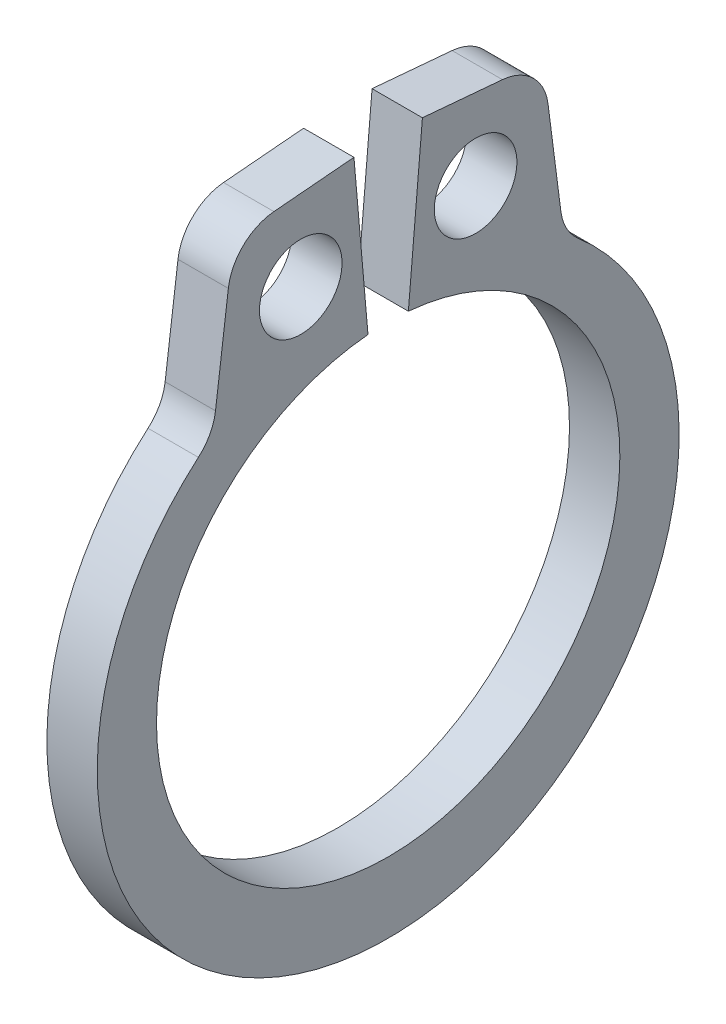
ISO-10303-21;
HEADER;
FILE_DESCRIPTION(('STEP AP214'),'2;1');
FILE_NAME('part.step','',(''),(''),'','','');
FILE_SCHEMA(('AUTOMOTIVE_DESIGN { 1 0 10303 214 1 1 1 1 }'));
ENDSEC;
DATA;
#1=APPLICATION_CONTEXT('core data for automotive mechanical design processes');
#2=APPLICATION_PROTOCOL_DEFINITION('international standard','automotive_design',2000,#1);
#3=PRODUCT_CONTEXT('',#1,'mechanical');
#4=PRODUCT('Part','Part','',(#3));
#5=PRODUCT_RELATED_PRODUCT_CATEGORY('part','',(#4));
#6=PRODUCT_DEFINITION_FORMATION('','',#4);
#7=PRODUCT_DEFINITION_CONTEXT('part definition',#1,'design');
#8=PRODUCT_DEFINITION('design','',#6,#7);
#9=PRODUCT_DEFINITION_SHAPE('','',#8);
#10=(LENGTH_UNIT() NAMED_UNIT(*) SI_UNIT(.MILLI.,.METRE.));
#11=(NAMED_UNIT(*) PLANE_ANGLE_UNIT() SI_UNIT($,.RADIAN.));
#12=(NAMED_UNIT(*) SI_UNIT($,.STERADIAN.) SOLID_ANGLE_UNIT());
#13=UNCERTAINTY_MEASURE_WITH_UNIT(LENGTH_MEASURE(1.E-05),#10,'distance_accuracy_value','');
#14=(GEOMETRIC_REPRESENTATION_CONTEXT(3) GLOBAL_UNCERTAINTY_ASSIGNED_CONTEXT((#13)) GLOBAL_UNIT_ASSIGNED_CONTEXT((#10,
#11,#12)) REPRESENTATION_CONTEXT('',''));
#15=CARTESIAN_POINT('',(0.,0.,0.));
#16=DIRECTION('',(0.,0.,1.));
#17=DIRECTION('',(1.,0.,0.));
#18=AXIS2_PLACEMENT_3D('',#15,#16,#17);
#19=CARTESIAN_POINT('',(0.3175,0.,0.));
#20=DIRECTION('',(1.,0.,0.));
#21=DIRECTION('',(0.,0.,-1.));
#22=AXIS2_PLACEMENT_3D('',#19,#20,#21);
#23=PLANE('',#22);
#24=CARTESIAN_POINT('',(0.3175,3.85560585041349,-1.10223251914344));
#25=DIRECTION('',(-1.,0.,0.));
#26=DIRECTION('',(0.,0.,1.));
#27=AXIS2_PLACEMENT_3D('',#24,#25,#26);
#28=CIRCLE('',#27,0.5207);
#29=CARTESIAN_POINT('',(0.3175,3.85560585041349,-0.581532519143441));
#30=VERTEX_POINT('',#29);
#31=EDGE_CURVE('E108',#30,#30,#28,.T.);
#32=ORIENTED_EDGE('',*,*,#31,.T.);
#33=EDGE_LOOP('',(#32));
#34=FACE_BOUND('',#33,.T.);
#35=CARTESIAN_POINT('',(0.3175,0.,0.));
#36=DIRECTION('',(-1.,0.,0.));
#37=DIRECTION('',(0.,0.,1.));
#38=AXIS2_PLACEMENT_3D('',#35,#36,#37);
#39=CIRCLE('',#38,2.921);
#40=CARTESIAN_POINT('',(0.3175,2.90988471312599,-0.25458192456591));
#41=VERTEX_POINT('',#40);
#42=CARTESIAN_POINT('',(0.3175,2.90988471312599,0.25458192456591));
#43=VERTEX_POINT('',#42);
#44=EDGE_CURVE('E174',#41,#43,#39,.T.);
#45=ORIENTED_EDGE('',*,*,#44,.T.);
#46=DIRECTION('',(0.,-0.996194698091746,-0.0871557427476584));
#47=VECTOR('',#46,1.);
#48=CARTESIAN_POINT('',(0.3175,2.90988471312599,0.25458192456591));
#49=LINE('',#48,#47);
#50=CARTESIAN_POINT('',(0.3175,4.93415233964842,0.431682393829152));
#51=VERTEX_POINT('',#50);
#52=EDGE_CURVE('E124',#43,#51,#49,.F.);
#53=ORIENTED_EDGE('',*,*,#52,.T.);
#54=DIRECTION('',(0.,0.0871557427476587,-0.996194698091746));
#55=VECTOR('',#54,1.);
#56=CARTESIAN_POINT('',(0.3175,4.93415233964842,0.431682393829152));
#57=LINE('',#56,#55);
#58=CARTESIAN_POINT('',(0.3175,4.84586515186069,1.44080956790658));
#59=VERTEX_POINT('',#58);
#60=EDGE_CURVE('E119',#51,#59,#57,.F.);
#61=ORIENTED_EDGE('',*,*,#60,.T.);
#62=CARTESIAN_POINT('',(0.3175,4.21328151857243,1.38546567126182));
#63=DIRECTION('',(-1.,0.,0.));
#64=DIRECTION('',(0.,0.,1.));
#65=AXIS2_PLACEMENT_3D('',#62,#63,#64);
#66=CIRCLE('',#65,0.635);
#67=CARTESIAN_POINT('',(0.3175,4.2945067237745,2.01524933732492));
#68=VERTEX_POINT('',#67);
#69=EDGE_CURVE('E112',#68,#59,#66,.T.);
#70=ORIENTED_EDGE('',*,*,#69,.F.);
#71=DIRECTION('',(0.,0.991785300886776,-0.127913708979639));
#72=VECTOR('',#71,1.);
#73=CARTESIAN_POINT('',(0.3175,4.80132698770098,1.94988311372097));
#74=LINE('',#73,#72);
#75=CARTESIAN_POINT('',(0.3175,3.03853740820642,2.17723570007429));
#76=VERTEX_POINT('',#75);
#77=EDGE_CURVE('E107',#68,#76,#74,.F.);
#78=ORIENTED_EDGE('',*,*,#77,.T.);
#79=CARTESIAN_POINT('',(0.3175,3.11976261340849,2.80701936613739));
#80=DIRECTION('',(-1.,0.,0.));
#81=DIRECTION('',(0.,0.,1.));
#82=AXIS2_PLACEMENT_3D('',#79,#80,#81);
#83=CIRCLE('',#82,0.635);
#84=CARTESIAN_POINT('',(0.3175,2.63846487393826,2.39280023816181));
#85=VERTEX_POINT('',#84);
#86=EDGE_CURVE('E98',#76,#85,#83,.T.);
#87=ORIENTED_EDGE('',*,*,#86,.T.);
#88=CARTESIAN_POINT('',(0.3175,-0.141825237867011,0.));
#89=DIRECTION('',(-1.,0.,0.));
#90=DIRECTION('',(0.,0.,1.));
#91=AXIS2_PLACEMENT_3D('',#88,#89,#90);
#92=CIRCLE('',#91,3.66817476213299);
#93=CARTESIAN_POINT('',(0.3175,2.63846487393826,-2.39280023816181));
#94=VERTEX_POINT('',#93);
#95=EDGE_CURVE('E181',#94,#85,#92,.T.);
#96=ORIENTED_EDGE('',*,*,#95,.F.);
#97=CARTESIAN_POINT('',(0.3175,3.11976261340849,-2.80701936613739));
#98=DIRECTION('',(-1.,0.,0.));
#99=DIRECTION('',(0.,0.,1.));
#100=AXIS2_PLACEMENT_3D('',#97,#98,#99);
#101=CIRCLE('',#100,0.635);
#102=CARTESIAN_POINT('',(0.3175,3.03853740820642,-2.17723570007429));
#103=VERTEX_POINT('',#102);
#104=EDGE_CURVE('E178',#94,#103,#101,.T.);
#105=ORIENTED_EDGE('',*,*,#104,.T.);
#106=DIRECTION('',(0.,-0.991785300886776,-0.127913708979639));
#107=VECTOR('',#106,1.);
#108=CARTESIAN_POINT('',(0.3175,4.80132698770098,-1.94988311372097));
#109=LINE('',#108,#107);
#110=CARTESIAN_POINT('',(0.3175,4.2945067237745,-2.01524933732492));
#111=VERTEX_POINT('',#110);
#112=EDGE_CURVE('E143',#103,#111,#109,.F.);
#113=ORIENTED_EDGE('',*,*,#112,.T.);
#114=CARTESIAN_POINT('',(0.3175,4.21328151857243,-1.38546567126182));
#115=DIRECTION('',(-1.,0.,0.));
#116=DIRECTION('',(0.,0.,1.));
#117=AXIS2_PLACEMENT_3D('',#114,#115,#116);
#118=CIRCLE('',#117,0.635);
#119=CARTESIAN_POINT('',(0.3175,4.84586515186069,-1.44080956790658));
#120=VERTEX_POINT('',#119);
#121=EDGE_CURVE('E145',#120,#111,#118,.T.);
#122=ORIENTED_EDGE('',*,*,#121,.F.);
#123=DIRECTION('',(0.,-0.0871557427476587,-0.996194698091746));
#124=VECTOR('',#123,1.);
#125=CARTESIAN_POINT('',(0.3175,4.93415233964842,-0.431682393829152));
#126=LINE('',#125,#124);
#127=CARTESIAN_POINT('',(0.3175,4.93415233964842,-0.431682393829152));
#128=VERTEX_POINT('',#127);
#129=EDGE_CURVE('E137',#120,#128,#126,.F.);
#130=ORIENTED_EDGE('',*,*,#129,.T.);
#131=DIRECTION('',(0.,0.996194698091746,-0.0871557427476584));
#132=VECTOR('',#131,1.);
#133=CARTESIAN_POINT('',(0.3175,2.90988471312599,-0.25458192456591));
#134=LINE('',#133,#132);
#135=EDGE_CURVE('E130',#128,#41,#134,.F.);
#136=ORIENTED_EDGE('',*,*,#135,.T.);
#137=EDGE_LOOP('',(#45,#53,#61,#70,#78,#87,#96,#105,#113,#122,#130,#136));
#138=FACE_BOUND('',#137,.T.);
#139=CARTESIAN_POINT('',(0.3175,3.85560585041349,1.10223251914344));
#140=DIRECTION('',(-1.,0.,0.));
#141=DIRECTION('',(0.,0.,1.));
#142=AXIS2_PLACEMENT_3D('',#139,#140,#141);
#143=CIRCLE('',#142,0.5207);
#144=CARTESIAN_POINT('',(0.3175,3.85560585041349,1.62293251914344));
#145=VERTEX_POINT('',#144);
#146=EDGE_CURVE('E20',#145,#145,#143,.T.);
#147=ORIENTED_EDGE('',*,*,#146,.T.);
#148=EDGE_LOOP('',(#147));
#149=FACE_BOUND('',#148,.T.);
#150=ADVANCED_FACE('F17',(#34,#138,#149),#23,.T.);
#151=CARTESIAN_POINT('',(0.3175,3.85560585041349,1.10223251914344));
#152=DIRECTION('',(-1.,0.,0.));
#153=DIRECTION('',(0.,0.,1.));
#154=AXIS2_PLACEMENT_3D('',#151,#152,#153);
#155=CYLINDRICAL_SURFACE('',#154,0.5207);
#156=CARTESIAN_POINT('',(-0.3175,3.85560585041349,1.10223251914344));
#157=DIRECTION('',(-1.,0.,0.));
#158=DIRECTION('',(0.,0.,1.));
#159=AXIS2_PLACEMENT_3D('',#156,#157,#158);
#160=CIRCLE('',#159,0.5207);
#161=CARTESIAN_POINT('',(-0.3175,3.85560585041349,1.62293251914344));
#162=VERTEX_POINT('',#161);
#163=EDGE_CURVE('E168',#162,#162,#160,.T.);
#164=ORIENTED_EDGE('',*,*,#163,.T.);
#165=EDGE_LOOP('',(#164));
#166=FACE_BOUND('',#165,.T.);
#167=ORIENTED_EDGE('',*,*,#146,.F.);
#168=EDGE_LOOP('',(#167));
#169=FACE_BOUND('',#168,.T.);
#170=ADVANCED_FACE('F388',(#166,#169),#155,.F.);
#171=CARTESIAN_POINT('',(0.3175,3.11976261340849,2.80701936613739));
#172=DIRECTION('',(-1.,0.,0.));
#173=DIRECTION('',(0.,0.,1.));
#174=AXIS2_PLACEMENT_3D('',#171,#172,#173);
#175=CYLINDRICAL_SURFACE('',#174,0.635);
#176=DIRECTION('',(1.,0.,0.));
#177=VECTOR('',#176,1.);
#178=CARTESIAN_POINT('',(0.3175,3.03853740820642,2.17723570007429));
#179=LINE('',#178,#177);
#180=CARTESIAN_POINT('',(-0.3175,3.03853740820642,2.17723570007429));
#181=VERTEX_POINT('',#180);
#182=EDGE_CURVE('E102',#76,#181,#179,.F.);
#183=ORIENTED_EDGE('',*,*,#182,.T.);
#184=CARTESIAN_POINT('',(-0.3175,3.11976261340849,2.80701936613739));
#185=DIRECTION('',(-1.,0.,0.));
#186=DIRECTION('',(0.,0.,1.));
#187=AXIS2_PLACEMENT_3D('',#184,#185,#186);
#188=CIRCLE('',#187,0.635);
#189=CARTESIAN_POINT('',(-0.3175,2.63846487393826,2.39280023816181));
#190=VERTEX_POINT('',#189);
#191=EDGE_CURVE('E166',#181,#190,#188,.T.);
#192=ORIENTED_EDGE('',*,*,#191,.T.);
#193=DIRECTION('',(-1.,0.,0.));
#194=VECTOR('',#193,1.);
#195=CARTESIAN_POINT('',(0.3175,2.63846487393826,2.39280023816181));
#196=LINE('',#195,#194);
#197=EDGE_CURVE('E103',#85,#190,#196,.T.);
#198=ORIENTED_EDGE('',*,*,#197,.F.);
#199=ORIENTED_EDGE('',*,*,#86,.F.);
#200=EDGE_LOOP('',(#183,#192,#198,#199));
#201=FACE_BOUND('',#200,.T.);
#202=ADVANCED_FACE('F100',(#201),#175,.F.);
#203=CARTESIAN_POINT('',(0.3175,-0.141825237867011,0.));
#204=DIRECTION('',(-1.,0.,0.));
#205=DIRECTION('',(0.,0.,1.));
#206=AXIS2_PLACEMENT_3D('',#203,#204,#205);
#207=CYLINDRICAL_SURFACE('',#206,3.66817476213299);
#208=CARTESIAN_POINT('',(-0.3175,-0.141825237867011,0.));
#209=DIRECTION('',(-1.,0.,0.));
#210=DIRECTION('',(0.,0.,1.));
#211=AXIS2_PLACEMENT_3D('',#208,#209,#210);
#212=CIRCLE('',#211,3.66817476213299);
#213=CARTESIAN_POINT('',(-0.3175,2.63846487393826,-2.39280023816181));
#214=VERTEX_POINT('',#213);
#215=EDGE_CURVE('E164',#190,#214,#212,.F.);
#216=ORIENTED_EDGE('',*,*,#215,.T.);
#217=DIRECTION('',(-1.,0.,0.));
#218=VECTOR('',#217,1.);
#219=CARTESIAN_POINT('',(0.3175,2.63846487393826,-2.39280023816181));
#220=LINE('',#219,#218);
#221=EDGE_CURVE('E180',#214,#94,#220,.F.);
#222=ORIENTED_EDGE('',*,*,#221,.T.);
#223=ORIENTED_EDGE('',*,*,#95,.T.);
#224=ORIENTED_EDGE('',*,*,#197,.T.);
#225=EDGE_LOOP('',(#216,#222,#223,#224));
#226=FACE_BOUND('',#225,.T.);
#227=ADVANCED_FACE('F186',(#226),#207,.T.);
#228=CARTESIAN_POINT('',(0.3175,3.11976261340849,-2.80701936613739));
#229=DIRECTION('',(-1.,0.,0.));
#230=DIRECTION('',(0.,0.,1.));
#231=AXIS2_PLACEMENT_3D('',#228,#229,#230);
#232=CYLINDRICAL_SURFACE('',#231,0.635);
#233=ORIENTED_EDGE('',*,*,#221,.F.);
#234=CARTESIAN_POINT('',(-0.3175,3.11976261340849,-2.80701936613739));
#235=DIRECTION('',(-1.,0.,0.));
#236=DIRECTION('',(0.,0.,1.));
#237=AXIS2_PLACEMENT_3D('',#234,#235,#236);
#238=CIRCLE('',#237,0.635);
#239=CARTESIAN_POINT('',(-0.3175,3.03853740820642,-2.17723570007429));
#240=VERTEX_POINT('',#239);
#241=EDGE_CURVE('E161',#214,#240,#238,.T.);
#242=ORIENTED_EDGE('',*,*,#241,.T.);
#243=DIRECTION('',(1.,0.,0.));
#244=VECTOR('',#243,1.);
#245=CARTESIAN_POINT('',(0.3175,3.03853740820642,-2.17723570007429));
#246=LINE('',#245,#244);
#247=EDGE_CURVE('E146',#240,#103,#246,.T.);
#248=ORIENTED_EDGE('',*,*,#247,.T.);
#249=ORIENTED_EDGE('',*,*,#104,.F.);
#250=EDGE_LOOP('',(#233,#242,#248,#249));
#251=FACE_BOUND('',#250,.T.);
#252=ADVANCED_FACE('F198',(#251),#232,.F.);
#253=CARTESIAN_POINT('',(0.3175,4.80132698770098,-1.94988311372097));
#254=DIRECTION('',(0.,-0.127913708979639,0.991785300886776));
#255=DIRECTION('',(0.,-0.991785300886776,-0.127913708979639));
#256=AXIS2_PLACEMENT_3D('',#253,#254,#255);
#257=PLANE('',#256);
#258=ORIENTED_EDGE('',*,*,#247,.F.);
#259=DIRECTION('',(0.,0.991785300886776,0.127913708979639));
#260=VECTOR('',#259,1.);
#261=CARTESIAN_POINT('',(-0.3175,3.03853740820642,-2.17723570007429));
#262=LINE('',#261,#260);
#263=CARTESIAN_POINT('',(-0.3175,4.2945067237745,-2.01524933732492));
#264=VERTEX_POINT('',#263);
#265=EDGE_CURVE('E160',#240,#264,#262,.T.);
#266=ORIENTED_EDGE('',*,*,#265,.T.);
#267=DIRECTION('',(-1.,0.,0.));
#268=VECTOR('',#267,1.);
#269=CARTESIAN_POINT('',(0.3175,4.2945067237745,-2.01524933732492));
#270=LINE('',#269,#268);
#271=EDGE_CURVE('E177',#111,#264,#270,.T.);
#272=ORIENTED_EDGE('',*,*,#271,.F.);
#273=ORIENTED_EDGE('',*,*,#112,.F.);
#274=EDGE_LOOP('',(#258,#266,#272,#273));
#275=FACE_BOUND('',#274,.T.);
#276=ADVANCED_FACE('F203',(#275),#257,.F.);
#277=CARTESIAN_POINT('',(0.3175,4.21328151857243,-1.38546567126182));
#278=DIRECTION('',(-1.,0.,0.));
#279=DIRECTION('',(0.,0.,1.));
#280=AXIS2_PLACEMENT_3D('',#277,#278,#279);
#281=CYLINDRICAL_SURFACE('',#280,0.635);
#282=CARTESIAN_POINT('',(-0.3175,4.21328151857243,-1.38546567126182));
#283=DIRECTION('',(-1.,0.,0.));
#284=DIRECTION('',(0.,0.,1.));
#285=AXIS2_PLACEMENT_3D('',#282,#283,#284);
#286=CIRCLE('',#285,0.635);
#287=CARTESIAN_POINT('',(-0.3175,4.84586515186069,-1.44080956790658));
#288=VERTEX_POINT('',#287);
#289=EDGE_CURVE('E156',#264,#288,#286,.F.);
#290=ORIENTED_EDGE('',*,*,#289,.T.);
#291=DIRECTION('',(1.,0.,0.));
#292=VECTOR('',#291,1.);
#293=CARTESIAN_POINT('',(0.3175,4.84586515186069,-1.44080956790658));
#294=LINE('',#293,#292);
#295=EDGE_CURVE('E140',#288,#120,#294,.T.);
#296=ORIENTED_EDGE('',*,*,#295,.T.);
#297=ORIENTED_EDGE('',*,*,#121,.T.);
#298=ORIENTED_EDGE('',*,*,#271,.T.);
#299=EDGE_LOOP('',(#290,#296,#297,#298));
#300=FACE_BOUND('',#299,.T.);
#301=ADVANCED_FACE('F266',(#300),#281,.T.);
#302=CARTESIAN_POINT('',(0.3175,4.93415233964842,-0.431682393829152));
#303=DIRECTION('',(0.,-0.996194698091746,0.0871557427476587));
#304=DIRECTION('',(0.,-0.0871557427476587,-0.996194698091746));
#305=AXIS2_PLACEMENT_3D('',#302,#303,#304);
#306=PLANE('',#305);
#307=ORIENTED_EDGE('',*,*,#295,.F.);
#308=DIRECTION('',(0.,0.0871557427476588,0.996194698091746));
#309=VECTOR('',#308,1.);
#310=CARTESIAN_POINT('',(-0.3175,4.84586515186069,-1.44080956790658));
#311=LINE('',#310,#309);
#312=CARTESIAN_POINT('',(-0.3175,4.93415233964842,-0.431682393829152));
#313=VERTEX_POINT('',#312);
#314=EDGE_CURVE('E159',#288,#313,#311,.T.);
#315=ORIENTED_EDGE('',*,*,#314,.T.);
#316=DIRECTION('',(1.,0.,0.));
#317=VECTOR('',#316,1.);
#318=CARTESIAN_POINT('',(0.3175,4.93415233964842,-0.431682393829152));
#319=LINE('',#318,#317);
#320=EDGE_CURVE('E134',#313,#128,#319,.T.);
#321=ORIENTED_EDGE('',*,*,#320,.T.);
#322=ORIENTED_EDGE('',*,*,#129,.F.);
#323=EDGE_LOOP('',(#307,#315,#321,#322));
#324=FACE_BOUND('',#323,.T.);
#325=ADVANCED_FACE('F264',(#324),#306,.F.);
#326=CARTESIAN_POINT('',(0.3175,2.90988471312599,-0.25458192456591));
#327=DIRECTION('',(0.,-0.0871557427476584,-0.996194698091746));
#328=DIRECTION('',(0.,0.996194698091746,-0.0871557427476584));
#329=AXIS2_PLACEMENT_3D('',#326,#327,#328);
#330=PLANE('',#329);
#331=DIRECTION('',(-1.,0.,0.));
#332=VECTOR('',#331,1.);
#333=CARTESIAN_POINT('',(0.3175,2.90988471312599,-0.25458192456591));
#334=LINE('',#333,#332);
#335=CARTESIAN_POINT('',(-0.3175,2.90988471312599,-0.25458192456591));
#336=VERTEX_POINT('',#335);
#337=EDGE_CURVE('E133',#336,#41,#334,.F.);
#338=ORIENTED_EDGE('',*,*,#337,.T.);
#339=ORIENTED_EDGE('',*,*,#135,.F.);
#340=ORIENTED_EDGE('',*,*,#320,.F.);
#341=DIRECTION('',(0.,-0.996194698091746,0.0871557427476584));
#342=VECTOR('',#341,1.);
#343=CARTESIAN_POINT('',(-0.3175,4.93415233964842,-0.431682393829152));
#344=LINE('',#343,#342);
#345=EDGE_CURVE('E155',#313,#336,#344,.T.);
#346=ORIENTED_EDGE('',*,*,#345,.T.);
#347=EDGE_LOOP('',(#338,#339,#340,#346));
#348=FACE_BOUND('',#347,.T.);
#349=ADVANCED_FACE('F259',(#348),#330,.F.);
#350=CARTESIAN_POINT('',(0.3175,0.,0.));
#351=DIRECTION('',(-1.,0.,0.));
#352=DIRECTION('',(0.,0.,1.));
#353=AXIS2_PLACEMENT_3D('',#350,#351,#352);
#354=CYLINDRICAL_SURFACE('',#353,2.921);
#355=ORIENTED_EDGE('',*,*,#44,.F.);
#356=ORIENTED_EDGE('',*,*,#337,.F.);
#357=CARTESIAN_POINT('',(-0.3175,0.,0.));
#358=DIRECTION('',(-1.,0.,0.));
#359=DIRECTION('',(0.,0.,1.));
#360=AXIS2_PLACEMENT_3D('',#357,#358,#359);
#361=CIRCLE('',#360,2.921);
#362=CARTESIAN_POINT('',(-0.3175,2.90988471312599,0.25458192456591));
#363=VERTEX_POINT('',#362);
#364=EDGE_CURVE('E152',#336,#363,#361,.T.);
#365=ORIENTED_EDGE('',*,*,#364,.T.);
#366=DIRECTION('',(1.,0.,0.));
#367=VECTOR('',#366,1.);
#368=CARTESIAN_POINT('',(0.3175,2.90988471312599,0.25458192456591));
#369=LINE('',#368,#367);
#370=EDGE_CURVE('E127',#363,#43,#369,.T.);
#371=ORIENTED_EDGE('',*,*,#370,.T.);
#372=EDGE_LOOP('',(#355,#356,#365,#371));
#373=FACE_BOUND('',#372,.T.);
#374=ADVANCED_FACE('F254',(#373),#354,.F.);
#375=CARTESIAN_POINT('',(0.3175,2.90988471312599,0.25458192456591));
#376=DIRECTION('',(0.,-0.0871557427476584,0.996194698091746));
#377=DIRECTION('',(0.,-0.996194698091746,-0.0871557427476584));
#378=AXIS2_PLACEMENT_3D('',#375,#376,#377);
#379=PLANE('',#378);
#380=DIRECTION('',(1.,0.,0.));
#381=VECTOR('',#380,1.);
#382=CARTESIAN_POINT('',(0.3175,4.93415233964842,0.431682393829152));
#383=LINE('',#382,#381);
#384=CARTESIAN_POINT('',(-0.3175,4.93415233964842,0.431682393829152));
#385=VERTEX_POINT('',#384);
#386=EDGE_CURVE('E121',#385,#51,#383,.T.);
#387=ORIENTED_EDGE('',*,*,#386,.T.);
#388=ORIENTED_EDGE('',*,*,#52,.F.);
#389=ORIENTED_EDGE('',*,*,#370,.F.);
#390=DIRECTION('',(0.,0.996194698091746,0.0871557427476584));
#391=VECTOR('',#390,1.);
#392=CARTESIAN_POINT('',(-0.3175,2.90988471312599,0.25458192456591));
#393=LINE('',#392,#391);
#394=EDGE_CURVE('E154',#363,#385,#393,.T.);
#395=ORIENTED_EDGE('',*,*,#394,.T.);
#396=EDGE_LOOP('',(#387,#388,#389,#395));
#397=FACE_BOUND('',#396,.T.);
#398=ADVANCED_FACE('F251',(#397),#379,.F.);
#399=CARTESIAN_POINT('',(0.3175,4.93415233964842,0.431682393829152));
#400=DIRECTION('',(0.,-0.996194698091746,-0.0871557427476587));
#401=DIRECTION('',(0.,0.0871557427476587,-0.996194698091746));
#402=AXIS2_PLACEMENT_3D('',#399,#400,#401);
#403=PLANE('',#402);
#404=DIRECTION('',(-1.,0.,0.));
#405=VECTOR('',#404,1.);
#406=CARTESIAN_POINT('',(0.3175,4.84586515186069,1.44080956790658));
#407=LINE('',#406,#405);
#408=CARTESIAN_POINT('',(-0.3175,4.84586515186069,1.44080956790658));
#409=VERTEX_POINT('',#408);
#410=EDGE_CURVE('E114',#59,#409,#407,.T.);
#411=ORIENTED_EDGE('',*,*,#410,.F.);
#412=ORIENTED_EDGE('',*,*,#60,.F.);
#413=ORIENTED_EDGE('',*,*,#386,.F.);
#414=DIRECTION('',(0.,-0.0871557427476588,0.996194698091746));
#415=VECTOR('',#414,1.);
#416=CARTESIAN_POINT('',(-0.3175,4.93415233964842,0.431682393829152));
#417=LINE('',#416,#415);
#418=EDGE_CURVE('E151',#385,#409,#417,.T.);
#419=ORIENTED_EDGE('',*,*,#418,.T.);
#420=EDGE_LOOP('',(#411,#412,#413,#419));
#421=FACE_BOUND('',#420,.T.);
#422=ADVANCED_FACE('F244',(#421),#403,.F.);
#423=CARTESIAN_POINT('',(0.3175,4.21328151857243,1.38546567126182));
#424=DIRECTION('',(-1.,0.,0.));
#425=DIRECTION('',(0.,0.,1.));
#426=AXIS2_PLACEMENT_3D('',#423,#424,#425);
#427=CYLINDRICAL_SURFACE('',#426,0.635);
#428=CARTESIAN_POINT('',(-0.3175,4.21328151857243,1.38546567126182));
#429=DIRECTION('',(-1.,0.,0.));
#430=DIRECTION('',(0.,0.,1.));
#431=AXIS2_PLACEMENT_3D('',#428,#429,#430);
#432=CIRCLE('',#431,0.635);
#433=CARTESIAN_POINT('',(-0.3175,4.2945067237745,2.01524933732492));
#434=VERTEX_POINT('',#433);
#435=EDGE_CURVE('E148',#409,#434,#432,.F.);
#436=ORIENTED_EDGE('',*,*,#435,.T.);
#437=DIRECTION('',(1.,0.,0.));
#438=VECTOR('',#437,1.);
#439=CARTESIAN_POINT('',(0.3175,4.2945067237745,2.01524933732492));
#440=LINE('',#439,#438);
#441=EDGE_CURVE('E35',#434,#68,#440,.T.);
#442=ORIENTED_EDGE('',*,*,#441,.T.);
#443=ORIENTED_EDGE('',*,*,#69,.T.);
#444=ORIENTED_EDGE('',*,*,#410,.T.);
#445=EDGE_LOOP('',(#436,#442,#443,#444));
#446=FACE_BOUND('',#445,.T.);
#447=ADVANCED_FACE('F289',(#446),#427,.T.);
#448=CARTESIAN_POINT('',(0.3175,4.80132698770098,1.94988311372097));
#449=DIRECTION('',(0.,-0.127913708979639,-0.991785300886776));
#450=DIRECTION('',(0.,0.991785300886776,-0.127913708979639));
#451=AXIS2_PLACEMENT_3D('',#448,#449,#450);
#452=PLANE('',#451);
#453=ORIENTED_EDGE('',*,*,#182,.F.);
#454=ORIENTED_EDGE('',*,*,#77,.F.);
#455=ORIENTED_EDGE('',*,*,#441,.F.);
#456=DIRECTION('',(0.,-0.991785300886776,0.127913708979639));
#457=VECTOR('',#456,1.);
#458=CARTESIAN_POINT('',(-0.3175,4.2945067237745,2.01524933732492));
#459=LINE('',#458,#457);
#460=EDGE_CURVE('E26',#434,#181,#459,.T.);
#461=ORIENTED_EDGE('',*,*,#460,.T.);
#462=EDGE_LOOP('',(#453,#454,#455,#461));
#463=FACE_BOUND('',#462,.T.);
#464=ADVANCED_FACE('F106',(#463),#452,.F.);
#465=CARTESIAN_POINT('',(0.3175,3.85560585041349,-1.10223251914344));
#466=DIRECTION('',(-1.,0.,0.));
#467=DIRECTION('',(0.,0.,1.));
#468=AXIS2_PLACEMENT_3D('',#465,#466,#467);
#469=CYLINDRICAL_SURFACE('',#468,0.5207);
#470=CARTESIAN_POINT('',(-0.3175,3.85560585041349,-1.10223251914344));
#471=DIRECTION('',(-1.,0.,0.));
#472=DIRECTION('',(0.,0.,1.));
#473=AXIS2_PLACEMENT_3D('',#470,#471,#472);
#474=CIRCLE('',#473,0.5207);
#475=CARTESIAN_POINT('',(-0.3175,3.85560585041349,-0.581532519143441));
#476=VERTEX_POINT('',#475);
#477=EDGE_CURVE('E11',#476,#476,#474,.T.);
#478=ORIENTED_EDGE('',*,*,#477,.T.);
#479=EDGE_LOOP('',(#478));
#480=FACE_BOUND('',#479,.T.);
#481=ORIENTED_EDGE('',*,*,#31,.F.);
#482=EDGE_LOOP('',(#481));
#483=FACE_BOUND('',#482,.T.);
#484=ADVANCED_FACE('F277',(#480,#483),#469,.F.);
#485=CARTESIAN_POINT('',(-0.3175,0.,0.));
#486=DIRECTION('',(1.,0.,0.));
#487=DIRECTION('',(0.,0.,-1.));
#488=AXIS2_PLACEMENT_3D('',#485,#486,#487);
#489=PLANE('',#488);
#490=ORIENTED_EDGE('',*,*,#477,.F.);
#491=EDGE_LOOP('',(#490));
#492=FACE_BOUND('',#491,.T.);
#493=ORIENTED_EDGE('',*,*,#435,.F.);
#494=ORIENTED_EDGE('',*,*,#418,.F.);
#495=ORIENTED_EDGE('',*,*,#394,.F.);
#496=ORIENTED_EDGE('',*,*,#364,.F.);
#497=ORIENTED_EDGE('',*,*,#345,.F.);
#498=ORIENTED_EDGE('',*,*,#314,.F.);
#499=ORIENTED_EDGE('',*,*,#289,.F.);
#500=ORIENTED_EDGE('',*,*,#265,.F.);
#501=ORIENTED_EDGE('',*,*,#241,.F.);
#502=ORIENTED_EDGE('',*,*,#215,.F.);
#503=ORIENTED_EDGE('',*,*,#191,.F.);
#504=ORIENTED_EDGE('',*,*,#460,.F.);
#505=EDGE_LOOP('',(#493,#494,#495,#496,#497,#498,#499,#500,#501,#502,#503,#504));
#506=FACE_BOUND('',#505,.T.);
#507=ORIENTED_EDGE('',*,*,#163,.F.);
#508=EDGE_LOOP('',(#507));
#509=FACE_BOUND('',#508,.T.);
#510=ADVANCED_FACE('F191',(#492,#506,#509),#489,.F.);
#511=CLOSED_SHELL('',(#150,#170,#202,#227,#252,#276,#301,#325,#349,#374,#398,#422,#447,#464,
#484,#510));
#512=MANIFOLD_SOLID_BREP('B1',#511);
#513=ADVANCED_BREP_SHAPE_REPRESENTATION('',(#18,#512),#14);
#514=SHAPE_DEFINITION_REPRESENTATION(#9,#513);
ENDSEC;
END-ISO-10303-21;
